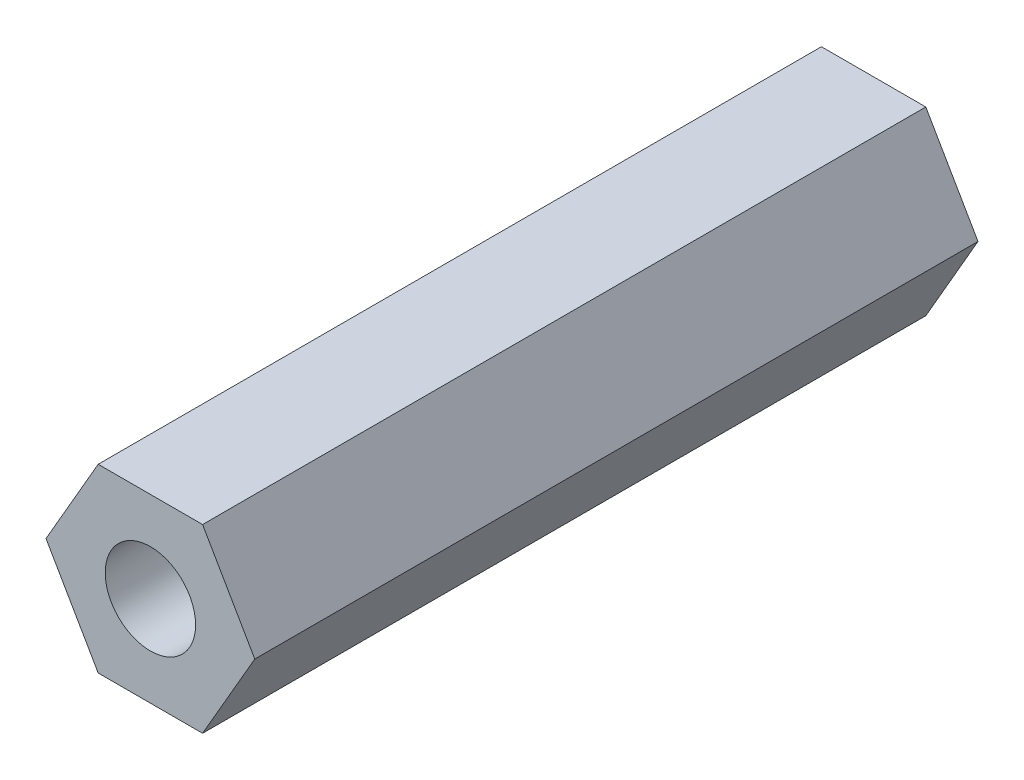
ISO-10303-21;
HEADER;
FILE_DESCRIPTION(('STEP AP214'),'2;1');
FILE_NAME('part.step','',(''),(''),'','','');
FILE_SCHEMA(('AUTOMOTIVE_DESIGN { 1 0 10303 214 1 1 1 1 }'));
ENDSEC;
DATA;
#1=APPLICATION_CONTEXT('core data for automotive mechanical design processes');
#2=APPLICATION_PROTOCOL_DEFINITION('international standard','automotive_design',2000,#1);
#3=PRODUCT_CONTEXT('',#1,'mechanical');
#4=PRODUCT('Part','Part','',(#3));
#5=PRODUCT_RELATED_PRODUCT_CATEGORY('part','',(#4));
#6=PRODUCT_DEFINITION_FORMATION('','',#4);
#7=PRODUCT_DEFINITION_CONTEXT('part definition',#1,'design');
#8=PRODUCT_DEFINITION('design','',#6,#7);
#9=PRODUCT_DEFINITION_SHAPE('','',#8);
#10=(LENGTH_UNIT() NAMED_UNIT(*) SI_UNIT(.MILLI.,.METRE.));
#11=(NAMED_UNIT(*) PLANE_ANGLE_UNIT() SI_UNIT($,.RADIAN.));
#12=(NAMED_UNIT(*) SI_UNIT($,.STERADIAN.) SOLID_ANGLE_UNIT());
#13=UNCERTAINTY_MEASURE_WITH_UNIT(LENGTH_MEASURE(1.E-05),#10,'distance_accuracy_value','');
#14=(GEOMETRIC_REPRESENTATION_CONTEXT(3) GLOBAL_UNCERTAINTY_ASSIGNED_CONTEXT((#13)) GLOBAL_UNIT_ASSIGNED_CONTEXT((#10,
#11,#12)) REPRESENTATION_CONTEXT('',''));
#15=CARTESIAN_POINT('',(0.,0.,0.));
#16=DIRECTION('',(0.,0.,1.));
#17=DIRECTION('',(1.,0.,0.));
#18=AXIS2_PLACEMENT_3D('',#15,#16,#17);
#19=CARTESIAN_POINT('',(2.88675134594813,0.,20.));
#20=DIRECTION('',(-0.866025403784438,-0.5,0.));
#21=DIRECTION('',(0.5,-0.866025403784439,0.));
#22=AXIS2_PLACEMENT_3D('',#19,#20,#21);
#23=PLANE('',#22);
#24=DIRECTION('',(-0.5,0.866025403784439,0.));
#25=VECTOR('',#24,1.);
#26=CARTESIAN_POINT('',(2.88675134594813,0.,0.));
#27=LINE('',#26,#25);
#28=CARTESIAN_POINT('',(2.88675134594813,0.,0.));
#29=VERTEX_POINT('',#28);
#30=CARTESIAN_POINT('',(1.44337567297406,2.5,0.));
#31=VERTEX_POINT('',#30);
#32=EDGE_CURVE('E120',#29,#31,#27,.T.);
#33=ORIENTED_EDGE('',*,*,#32,.T.);
#34=DIRECTION('',(0.,0.,-1.));
#35=VECTOR('',#34,1.);
#36=CARTESIAN_POINT('',(1.44337567297406,2.5,20.));
#37=LINE('',#36,#35);
#38=CARTESIAN_POINT('',(1.44337567297406,2.5,20.));
#39=VERTEX_POINT('',#38);
#40=EDGE_CURVE('E11',#39,#31,#37,.T.);
#41=ORIENTED_EDGE('',*,*,#40,.F.);
#42=DIRECTION('',(-0.5,0.866025403784439,0.));
#43=VECTOR('',#42,1.);
#44=CARTESIAN_POINT('',(2.88675134594813,0.,20.));
#45=LINE('',#44,#43);
#46=CARTESIAN_POINT('',(2.88675134594813,0.,20.));
#47=VERTEX_POINT('',#46);
#48=EDGE_CURVE('E131',#47,#39,#45,.T.);
#49=ORIENTED_EDGE('',*,*,#48,.F.);
#50=DIRECTION('',(0.,0.,-1.));
#51=VECTOR('',#50,1.);
#52=CARTESIAN_POINT('',(2.88675134594813,0.,20.));
#53=LINE('',#52,#51);
#54=EDGE_CURVE('E116',#47,#29,#53,.T.);
#55=ORIENTED_EDGE('',*,*,#54,.T.);
#56=EDGE_LOOP('',(#33,#41,#49,#55));
#57=FACE_BOUND('',#56,.T.);
#58=ADVANCED_FACE('F36',(#57),#23,.F.);
#59=CARTESIAN_POINT('',(1.44337567297406,2.5,20.));
#60=DIRECTION('',(0.,-1.,0.));
#61=DIRECTION('',(0.,0.,-1.));
#62=AXIS2_PLACEMENT_3D('',#59,#60,#61);
#63=PLANE('',#62);
#64=DIRECTION('',(-1.,0.,0.));
#65=VECTOR('',#64,1.);
#66=CARTESIAN_POINT('',(1.44337567297406,2.5,0.));
#67=LINE('',#66,#65);
#68=CARTESIAN_POINT('',(-1.44337567297406,2.5,0.));
#69=VERTEX_POINT('',#68);
#70=EDGE_CURVE('E123',#31,#69,#67,.T.);
#71=ORIENTED_EDGE('',*,*,#70,.T.);
#72=DIRECTION('',(0.,0.,-1.));
#73=VECTOR('',#72,1.);
#74=CARTESIAN_POINT('',(-1.44337567297406,2.5,20.));
#75=LINE('',#74,#73);
#76=CARTESIAN_POINT('',(-1.44337567297406,2.5,20.));
#77=VERTEX_POINT('',#76);
#78=EDGE_CURVE('E44',#77,#69,#75,.T.);
#79=ORIENTED_EDGE('',*,*,#78,.F.);
#80=DIRECTION('',(-1.,0.,0.));
#81=VECTOR('',#80,1.);
#82=CARTESIAN_POINT('',(1.44337567297406,2.5,20.));
#83=LINE('',#82,#81);
#84=EDGE_CURVE('E89',#39,#77,#83,.T.);
#85=ORIENTED_EDGE('',*,*,#84,.F.);
#86=ORIENTED_EDGE('',*,*,#40,.T.);
#87=EDGE_LOOP('',(#71,#79,#85,#86));
#88=FACE_BOUND('',#87,.T.);
#89=ADVANCED_FACE('F156',(#88),#63,.F.);
#90=CARTESIAN_POINT('',(-1.44337567297406,2.5,20.));
#91=DIRECTION('',(0.866025403784439,-0.5,0.));
#92=DIRECTION('',(0.5,0.866025403784439,0.));
#93=AXIS2_PLACEMENT_3D('',#90,#91,#92);
#94=PLANE('',#93);
#95=DIRECTION('',(-0.499999999999999,-0.866025403784439,0.));
#96=VECTOR('',#95,1.);
#97=CARTESIAN_POINT('',(-1.44337567297406,2.5,0.));
#98=LINE('',#97,#96);
#99=CARTESIAN_POINT('',(-2.88675134594813,0.,0.));
#100=VERTEX_POINT('',#99);
#101=EDGE_CURVE('E126',#69,#100,#98,.T.);
#102=ORIENTED_EDGE('',*,*,#101,.T.);
#103=DIRECTION('',(0.,0.,-1.));
#104=VECTOR('',#103,1.);
#105=CARTESIAN_POINT('',(-2.88675134594813,0.,20.));
#106=LINE('',#105,#104);
#107=CARTESIAN_POINT('',(-2.88675134594813,0.,20.));
#108=VERTEX_POINT('',#107);
#109=EDGE_CURVE('E111',#108,#100,#106,.T.);
#110=ORIENTED_EDGE('',*,*,#109,.F.);
#111=DIRECTION('',(-0.499999999999999,-0.866025403784439,0.));
#112=VECTOR('',#111,1.);
#113=CARTESIAN_POINT('',(-1.44337567297406,2.5,20.));
#114=LINE('',#113,#112);
#115=EDGE_CURVE('E102',#77,#108,#114,.T.);
#116=ORIENTED_EDGE('',*,*,#115,.F.);
#117=ORIENTED_EDGE('',*,*,#78,.T.);
#118=EDGE_LOOP('',(#102,#110,#116,#117));
#119=FACE_BOUND('',#118,.T.);
#120=ADVANCED_FACE('F137',(#119),#94,.F.);
#121=CARTESIAN_POINT('',(-2.88675134594813,0.,20.));
#122=DIRECTION('',(0.866025403784438,0.5,0.));
#123=DIRECTION('',(-0.5,0.866025403784439,0.));
#124=AXIS2_PLACEMENT_3D('',#121,#122,#123);
#125=PLANE('',#124);
#126=DIRECTION('',(0.5,-0.866025403784438,0.));
#127=VECTOR('',#126,1.);
#128=CARTESIAN_POINT('',(-2.88675134594813,0.,0.));
#129=LINE('',#128,#127);
#130=CARTESIAN_POINT('',(-1.44337567297406,-2.5,0.));
#131=VERTEX_POINT('',#130);
#132=EDGE_CURVE('E110',#100,#131,#129,.T.);
#133=ORIENTED_EDGE('',*,*,#132,.T.);
#134=DIRECTION('',(0.,0.,-1.));
#135=VECTOR('',#134,1.);
#136=CARTESIAN_POINT('',(-1.44337567297406,-2.5,20.));
#137=LINE('',#136,#135);
#138=CARTESIAN_POINT('',(-1.44337567297406,-2.5,20.));
#139=VERTEX_POINT('',#138);
#140=EDGE_CURVE('E107',#139,#131,#137,.T.);
#141=ORIENTED_EDGE('',*,*,#140,.F.);
#142=DIRECTION('',(0.5,-0.866025403784438,0.));
#143=VECTOR('',#142,1.);
#144=CARTESIAN_POINT('',(-2.88675134594813,0.,20.));
#145=LINE('',#144,#143);
#146=EDGE_CURVE('E96',#108,#139,#145,.T.);
#147=ORIENTED_EDGE('',*,*,#146,.F.);
#148=ORIENTED_EDGE('',*,*,#109,.T.);
#149=EDGE_LOOP('',(#133,#141,#147,#148));
#150=FACE_BOUND('',#149,.T.);
#151=ADVANCED_FACE('F108',(#150),#125,.F.);
#152=CARTESIAN_POINT('',(-1.44337567297406,-2.5,20.));
#153=DIRECTION('',(0.,1.,0.));
#154=DIRECTION('',(-1.,0.,0.));
#155=AXIS2_PLACEMENT_3D('',#152,#153,#154);
#156=PLANE('',#155);
#157=DIRECTION('',(1.,0.,0.));
#158=VECTOR('',#157,1.);
#159=CARTESIAN_POINT('',(-1.44337567297406,-2.5,0.));
#160=LINE('',#159,#158);
#161=CARTESIAN_POINT('',(1.44337567297407,-2.5,0.));
#162=VERTEX_POINT('',#161);
#163=EDGE_CURVE('E75',#131,#162,#160,.T.);
#164=ORIENTED_EDGE('',*,*,#163,.T.);
#165=DIRECTION('',(0.,0.,-1.));
#166=VECTOR('',#165,1.);
#167=CARTESIAN_POINT('',(1.44337567297407,-2.5,20.));
#168=LINE('',#167,#166);
#169=CARTESIAN_POINT('',(1.44337567297407,-2.5,20.));
#170=VERTEX_POINT('',#169);
#171=EDGE_CURVE('E112',#170,#162,#168,.T.);
#172=ORIENTED_EDGE('',*,*,#171,.F.);
#173=DIRECTION('',(1.,0.,0.));
#174=VECTOR('',#173,1.);
#175=CARTESIAN_POINT('',(-1.44337567297406,-2.5,20.));
#176=LINE('',#175,#174);
#177=EDGE_CURVE('E100',#139,#170,#176,.T.);
#178=ORIENTED_EDGE('',*,*,#177,.F.);
#179=ORIENTED_EDGE('',*,*,#140,.T.);
#180=EDGE_LOOP('',(#164,#172,#178,#179));
#181=FACE_BOUND('',#180,.T.);
#182=ADVANCED_FACE('F114',(#181),#156,.F.);
#183=CARTESIAN_POINT('',(1.44337567297407,-2.5,20.));
#184=DIRECTION('',(-0.866025403784439,0.5,0.));
#185=DIRECTION('',(-0.5,-0.866025403784439,0.));
#186=AXIS2_PLACEMENT_3D('',#183,#184,#185);
#187=PLANE('',#186);
#188=DIRECTION('',(0.5,0.866025403784439,0.));
#189=VECTOR('',#188,1.);
#190=CARTESIAN_POINT('',(1.44337567297407,-2.5,0.));
#191=LINE('',#190,#189);
#192=EDGE_CURVE('E81',#162,#29,#191,.T.);
#193=ORIENTED_EDGE('',*,*,#192,.T.);
#194=ORIENTED_EDGE('',*,*,#54,.F.);
#195=DIRECTION('',(0.5,0.866025403784439,0.));
#196=VECTOR('',#195,1.);
#197=CARTESIAN_POINT('',(1.44337567297407,-2.5,20.));
#198=LINE('',#197,#196);
#199=EDGE_CURVE('E52',#170,#47,#198,.T.);
#200=ORIENTED_EDGE('',*,*,#199,.F.);
#201=ORIENTED_EDGE('',*,*,#171,.T.);
#202=EDGE_LOOP('',(#193,#194,#200,#201));
#203=FACE_BOUND('',#202,.T.);
#204=ADVANCED_FACE('F144',(#203),#187,.F.);
#205=CARTESIAN_POINT('',(0.,0.,20.));
#206=DIRECTION('',(0.,0.,1.));
#207=DIRECTION('',(1.,0.,0.));
#208=AXIS2_PLACEMENT_3D('',#205,#206,#207);
#209=PLANE('',#208);
#210=CARTESIAN_POINT('',(0.,0.,20.));
#211=DIRECTION('',(0.,0.,1.));
#212=DIRECTION('',(1.,0.,0.));
#213=AXIS2_PLACEMENT_3D('',#210,#211,#212);
#214=CIRCLE('',#213,1.25);
#215=CARTESIAN_POINT('',(1.25,0.,20.));
#216=VERTEX_POINT('',#215);
#217=EDGE_CURVE('E213',#216,#216,#214,.T.);
#218=ORIENTED_EDGE('',*,*,#217,.F.);
#219=EDGE_LOOP('',(#218));
#220=FACE_BOUND('',#219,.T.);
#221=ORIENTED_EDGE('',*,*,#48,.T.);
#222=ORIENTED_EDGE('',*,*,#84,.T.);
#223=ORIENTED_EDGE('',*,*,#115,.T.);
#224=ORIENTED_EDGE('',*,*,#146,.T.);
#225=ORIENTED_EDGE('',*,*,#177,.T.);
#226=ORIENTED_EDGE('',*,*,#199,.T.);
#227=EDGE_LOOP('',(#221,#222,#223,#224,#225,#226));
#228=FACE_BOUND('',#227,.T.);
#229=ADVANCED_FACE('F98',(#220,#228),#209,.T.);
#230=CARTESIAN_POINT('',(0.,0.,0.));
#231=DIRECTION('',(0.,0.,1.));
#232=DIRECTION('',(1.,0.,0.));
#233=AXIS2_PLACEMENT_3D('',#230,#231,#232);
#234=PLANE('',#233);
#235=CARTESIAN_POINT('',(0.,0.,0.));
#236=DIRECTION('',(0.,0.,1.));
#237=DIRECTION('',(1.,0.,0.));
#238=AXIS2_PLACEMENT_3D('',#235,#236,#237);
#239=CIRCLE('',#238,1.25);
#240=CARTESIAN_POINT('',(1.25,0.,0.));
#241=VERTEX_POINT('',#240);
#242=EDGE_CURVE('E124',#241,#241,#239,.T.);
#243=ORIENTED_EDGE('',*,*,#242,.T.);
#244=EDGE_LOOP('',(#243));
#245=FACE_BOUND('',#244,.T.);
#246=ORIENTED_EDGE('',*,*,#32,.F.);
#247=ORIENTED_EDGE('',*,*,#192,.F.);
#248=ORIENTED_EDGE('',*,*,#163,.F.);
#249=ORIENTED_EDGE('',*,*,#132,.F.);
#250=ORIENTED_EDGE('',*,*,#101,.F.);
#251=ORIENTED_EDGE('',*,*,#70,.F.);
#252=EDGE_LOOP('',(#246,#247,#248,#249,#250,#251));
#253=FACE_BOUND('',#252,.T.);
#254=ADVANCED_FACE('F140',(#245,#253),#234,.F.);
#255=CARTESIAN_POINT('',(0.,0.,20.));
#256=DIRECTION('',(0.,0.,1.));
#257=DIRECTION('',(1.,0.,0.));
#258=AXIS2_PLACEMENT_3D('',#255,#256,#257);
#259=CYLINDRICAL_SURFACE('',#258,1.25);
#260=ORIENTED_EDGE('',*,*,#242,.F.);
#261=EDGE_LOOP('',(#260));
#262=FACE_BOUND('',#261,.T.);
#263=ORIENTED_EDGE('',*,*,#217,.T.);
#264=EDGE_LOOP('',(#263));
#265=FACE_BOUND('',#264,.T.);
#266=ADVANCED_FACE('F193',(#262,#265),#259,.F.);
#267=CLOSED_SHELL('',(#58,#89,#120,#151,#182,#204,#229,#254,#266));
#268=MANIFOLD_SOLID_BREP('B2',#267);
#269=ADVANCED_BREP_SHAPE_REPRESENTATION('',(#18,#268),#14);
#270=SHAPE_DEFINITION_REPRESENTATION(#9,#269);
ENDSEC;
END-ISO-10303-21;
